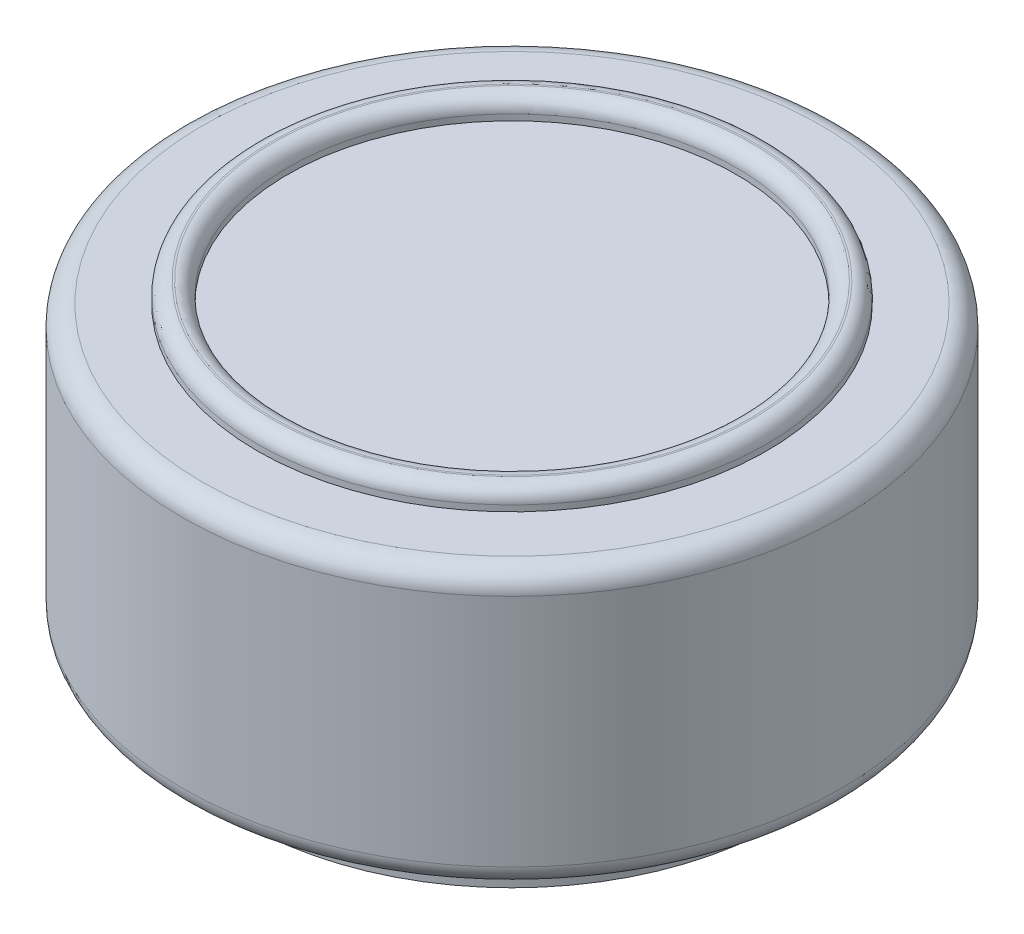
ISO-10303-21;
HEADER;
FILE_DESCRIPTION(('STEP AP214'),'2;1');
FILE_NAME('part.step','',(''),(''),'','','');
FILE_SCHEMA(('AUTOMOTIVE_DESIGN { 1 0 10303 214 1 1 1 1 }'));
ENDSEC;
DATA;
#1=APPLICATION_CONTEXT('core data for automotive mechanical design processes');
#2=APPLICATION_PROTOCOL_DEFINITION('international standard','automotive_design',2000,#1);
#3=PRODUCT_CONTEXT('',#1,'mechanical');
#4=PRODUCT('Part','Part','',(#3));
#5=PRODUCT_RELATED_PRODUCT_CATEGORY('part','',(#4));
#6=PRODUCT_DEFINITION_FORMATION('','',#4);
#7=PRODUCT_DEFINITION_CONTEXT('part definition',#1,'design');
#8=PRODUCT_DEFINITION('design','',#6,#7);
#9=PRODUCT_DEFINITION_SHAPE('','',#8);
#10=(LENGTH_UNIT() NAMED_UNIT(*) SI_UNIT(.MILLI.,.METRE.));
#11=(NAMED_UNIT(*) PLANE_ANGLE_UNIT() SI_UNIT($,.RADIAN.));
#12=(NAMED_UNIT(*) SI_UNIT($,.STERADIAN.) SOLID_ANGLE_UNIT());
#13=UNCERTAINTY_MEASURE_WITH_UNIT(LENGTH_MEASURE(1.E-05),#10,'distance_accuracy_value','');
#14=(GEOMETRIC_REPRESENTATION_CONTEXT(3) GLOBAL_UNCERTAINTY_ASSIGNED_CONTEXT((#13)) GLOBAL_UNIT_ASSIGNED_CONTEXT((#10,
#11,#12)) REPRESENTATION_CONTEXT('',''));
#15=CARTESIAN_POINT('',(0.,0.,0.));
#16=DIRECTION('',(0.,0.,1.));
#17=DIRECTION('',(1.,0.,0.));
#18=AXIS2_PLACEMENT_3D('',#15,#16,#17);
#19=CARTESIAN_POINT('',(0.,13.5,0.));
#20=DIRECTION('',(0.,-1.,0.));
#21=DIRECTION('',(0.,0.,-1.));
#22=AXIS2_PLACEMENT_3D('',#19,#20,#21);
#23=CYLINDRICAL_SURFACE('',#22,16.1655);
#24=CARTESIAN_POINT('',(0.,0.999999999999999,0.));
#25=DIRECTION('',(0.,1.,0.));
#26=DIRECTION('',(0.,0.,1.));
#27=AXIS2_PLACEMENT_3D('',#24,#25,#26);
#28=CIRCLE('',#27,16.1655);
#29=CARTESIAN_POINT('',(0.,0.999999999999999,16.1655));
#30=VERTEX_POINT('',#29);
#31=EDGE_CURVE('E63',#30,#30,#28,.T.);
#32=ORIENTED_EDGE('',*,*,#31,.T.);
#33=EDGE_LOOP('',(#32));
#34=FACE_BOUND('',#33,.T.);
#35=CARTESIAN_POINT('',(0.,12.5,0.));
#36=DIRECTION('',(0.,1.,0.));
#37=DIRECTION('',(0.,0.,1.));
#38=AXIS2_PLACEMENT_3D('',#35,#36,#37);
#39=CIRCLE('',#38,16.1655);
#40=CARTESIAN_POINT('',(0.,12.5,16.1655));
#41=VERTEX_POINT('',#40);
#42=EDGE_CURVE('E66',#41,#41,#39,.F.);
#43=ORIENTED_EDGE('',*,*,#42,.T.);
#44=EDGE_LOOP('',(#43));
#45=FACE_BOUND('',#44,.T.);
#46=ADVANCED_FACE('F31',(#34,#45),#23,.T.);
#47=CARTESIAN_POINT('',(0.,13.5,0.));
#48=DIRECTION('',(0.,1.,0.));
#49=DIRECTION('',(0.,0.,1.));
#50=AXIS2_PLACEMENT_3D('',#47,#48,#49);
#51=PLANE('',#50);
#52=CARTESIAN_POINT('',(0.,13.5,0.));
#53=DIRECTION('',(0.,1.,0.));
#54=DIRECTION('',(0.,0.,1.));
#55=AXIS2_PLACEMENT_3D('',#52,#53,#54);
#56=CIRCLE('',#55,12.5);
#57=CARTESIAN_POINT('',(0.,13.5,12.5));
#58=VERTEX_POINT('',#57);
#59=EDGE_CURVE('E69',#58,#58,#56,.T.);
#60=ORIENTED_EDGE('',*,*,#59,.F.);
#61=EDGE_LOOP('',(#60));
#62=FACE_BOUND('',#61,.T.);
#63=CARTESIAN_POINT('',(0.,13.5,0.));
#64=DIRECTION('',(0.,1.,0.));
#65=DIRECTION('',(0.,0.,1.));
#66=AXIS2_PLACEMENT_3D('',#63,#64,#65);
#67=CIRCLE('',#66,15.1655);
#68=CARTESIAN_POINT('',(0.,13.5,15.1655));
#69=VERTEX_POINT('',#68);
#70=EDGE_CURVE('E57',#69,#69,#67,.T.);
#71=ORIENTED_EDGE('',*,*,#70,.T.);
#72=EDGE_LOOP('',(#71));
#73=FACE_BOUND('',#72,.T.);
#74=ADVANCED_FACE('F90',(#62,#73),#51,.T.);
#75=CARTESIAN_POINT('',(0.,0.,0.));
#76=DIRECTION('',(0.,1.,0.));
#77=DIRECTION('',(0.,0.,1.));
#78=AXIS2_PLACEMENT_3D('',#75,#76,#77);
#79=PLANE('',#78);
#80=CARTESIAN_POINT('',(0.,0.,0.));
#81=DIRECTION('',(0.,1.,0.));
#82=DIRECTION('',(0.,0.,1.));
#83=AXIS2_PLACEMENT_3D('',#80,#81,#82);
#84=CIRCLE('',#83,13.1685147684479);
#85=CARTESIAN_POINT('',(0.,0.,13.1685147684479));
#86=VERTEX_POINT('',#85);
#87=EDGE_CURVE('E10',#86,#86,#84,.F.);
#88=ORIENTED_EDGE('',*,*,#87,.F.);
#89=EDGE_LOOP('',(#88));
#90=FACE_BOUND('',#89,.T.);
#91=CARTESIAN_POINT('',(0.,0.,0.));
#92=DIRECTION('',(0.,1.,0.));
#93=DIRECTION('',(0.,0.,1.));
#94=AXIS2_PLACEMENT_3D('',#91,#92,#93);
#95=CIRCLE('',#94,15.1655);
#96=CARTESIAN_POINT('',(0.,0.,15.1655));
#97=VERTEX_POINT('',#96);
#98=EDGE_CURVE('E60',#97,#97,#95,.F.);
#99=ORIENTED_EDGE('',*,*,#98,.T.);
#100=EDGE_LOOP('',(#99));
#101=FACE_BOUND('',#100,.T.);
#102=ADVANCED_FACE('F97',(#90,#101),#79,.F.);
#103=CARTESIAN_POINT('',(0.,0.999999999999999,0.));
#104=DIRECTION('',(0.,1.,0.));
#105=DIRECTION('',(0.,0.,1.));
#106=AXIS2_PLACEMENT_3D('',#103,#104,#105);
#107=TOROIDAL_SURFACE('',#106,15.1655,1.);
#108=ORIENTED_EDGE('',*,*,#98,.F.);
#109=EDGE_LOOP('',(#108));
#110=FACE_BOUND('',#109,.T.);
#111=ORIENTED_EDGE('',*,*,#31,.F.);
#112=EDGE_LOOP('',(#111));
#113=FACE_BOUND('',#112,.T.);
#114=ADVANCED_FACE('F104',(#110,#113),#107,.T.);
#115=CARTESIAN_POINT('',(0.,12.5,0.));
#116=DIRECTION('',(0.,1.,0.));
#117=DIRECTION('',(0.,0.,1.));
#118=AXIS2_PLACEMENT_3D('',#115,#116,#117);
#119=TOROIDAL_SURFACE('',#118,15.1655,1.);
#120=ORIENTED_EDGE('',*,*,#42,.F.);
#121=EDGE_LOOP('',(#120));
#122=FACE_BOUND('',#121,.T.);
#123=ORIENTED_EDGE('',*,*,#70,.F.);
#124=EDGE_LOOP('',(#123));
#125=FACE_BOUND('',#124,.T.);
#126=ADVANCED_FACE('F107',(#122,#125),#119,.T.);
#127=CARTESIAN_POINT('',(0.,14.5,0.));
#128=DIRECTION('',(0.,1.,0.));
#129=DIRECTION('',(0.,0.,1.));
#130=AXIS2_PLACEMENT_3D('',#127,#128,#129);
#131=PLANE('',#130);
#132=CARTESIAN_POINT('',(0.,14.5,0.));
#133=DIRECTION('',(0.,1.,0.));
#134=DIRECTION('',(0.,0.,1.));
#135=AXIS2_PLACEMENT_3D('',#132,#133,#134);
#136=CIRCLE('',#135,11.707);
#137=CARTESIAN_POINT('',(0.,14.5,11.707));
#138=VERTEX_POINT('',#137);
#139=EDGE_CURVE('E42',#138,#138,#136,.F.);
#140=ORIENTED_EDGE('',*,*,#139,.T.);
#141=EDGE_LOOP('',(#140));
#142=FACE_BOUND('',#141,.T.);
#143=CARTESIAN_POINT('',(0.,14.5,0.));
#144=DIRECTION('',(0.,1.,0.));
#145=DIRECTION('',(0.,0.,1.));
#146=AXIS2_PLACEMENT_3D('',#143,#144,#145);
#147=CIRCLE('',#146,11.793);
#148=CARTESIAN_POINT('',(0.,14.5,11.793));
#149=VERTEX_POINT('',#148);
#150=EDGE_CURVE('E46',#149,#149,#147,.T.);
#151=ORIENTED_EDGE('',*,*,#150,.T.);
#152=EDGE_LOOP('',(#151));
#153=FACE_BOUND('',#152,.T.);
#154=ADVANCED_FACE('F110',(#142,#153),#131,.T.);
#155=CARTESIAN_POINT('',(0.,14.5,0.));
#156=DIRECTION('',(0.,-1.,0.));
#157=DIRECTION('',(0.,0.,-1.));
#158=AXIS2_PLACEMENT_3D('',#155,#156,#157);
#159=CYLINDRICAL_SURFACE('',#158,12.5);
#160=CARTESIAN_POINT('',(0.,13.793,0.));
#161=DIRECTION('',(0.,1.,0.));
#162=DIRECTION('',(0.,0.,1.));
#163=AXIS2_PLACEMENT_3D('',#160,#161,#162);
#164=CIRCLE('',#163,12.5);
#165=CARTESIAN_POINT('',(0.,13.793,12.5));
#166=VERTEX_POINT('',#165);
#167=EDGE_CURVE('E38',#166,#166,#164,.F.);
#168=ORIENTED_EDGE('',*,*,#167,.T.);
#169=EDGE_LOOP('',(#168));
#170=FACE_BOUND('',#169,.T.);
#171=ORIENTED_EDGE('',*,*,#59,.T.);
#172=EDGE_LOOP('',(#171));
#173=FACE_BOUND('',#172,.T.);
#174=ADVANCED_FACE('F125',(#170,#173),#159,.T.);
#175=CARTESIAN_POINT('',(0.,14.5,0.));
#176=DIRECTION('',(0.,-1.,0.));
#177=DIRECTION('',(0.,0.,-1.));
#178=AXIS2_PLACEMENT_3D('',#175,#176,#177);
#179=CYLINDRICAL_SURFACE('',#178,11.);
#180=CARTESIAN_POINT('',(0.,13.793,0.));
#181=DIRECTION('',(0.,1.,0.));
#182=DIRECTION('',(0.,0.,1.));
#183=AXIS2_PLACEMENT_3D('',#180,#181,#182);
#184=CIRCLE('',#183,11.);
#185=CARTESIAN_POINT('',(0.,13.793,11.));
#186=VERTEX_POINT('',#185);
#187=EDGE_CURVE('E51',#186,#186,#184,.T.);
#188=ORIENTED_EDGE('',*,*,#187,.T.);
#189=EDGE_LOOP('',(#188));
#190=FACE_BOUND('',#189,.T.);
#191=CARTESIAN_POINT('',(0.,13.5,0.));
#192=DIRECTION('',(0.,1.,0.));
#193=DIRECTION('',(0.,0.,1.));
#194=AXIS2_PLACEMENT_3D('',#191,#192,#193);
#195=CIRCLE('',#194,11.);
#196=CARTESIAN_POINT('',(0.,13.5,11.));
#197=VERTEX_POINT('',#196);
#198=EDGE_CURVE('E54',#197,#197,#195,.F.);
#199=ORIENTED_EDGE('',*,*,#198,.T.);
#200=EDGE_LOOP('',(#199));
#201=FACE_BOUND('',#200,.T.);
#202=ADVANCED_FACE('F118',(#190,#201),#179,.F.);
#203=ORIENTED_EDGE('',*,*,#198,.F.);
#204=EDGE_LOOP('',(#203));
#205=FACE_BOUND('',#204,.T.);
#206=ADVANCED_FACE('F100',(#205),#51,.T.);
#207=CARTESIAN_POINT('',(0.,13.793,0.));
#208=DIRECTION('',(0.,1.,0.));
#209=DIRECTION('',(0.,0.,1.));
#210=AXIS2_PLACEMENT_3D('',#207,#208,#209);
#211=TOROIDAL_SURFACE('',#210,11.707,0.707);
#212=ORIENTED_EDGE('',*,*,#139,.F.);
#213=EDGE_LOOP('',(#212));
#214=FACE_BOUND('',#213,.T.);
#215=ORIENTED_EDGE('',*,*,#187,.F.);
#216=EDGE_LOOP('',(#215));
#217=FACE_BOUND('',#216,.T.);
#218=ADVANCED_FACE('F86',(#214,#217),#211,.T.);
#219=CARTESIAN_POINT('',(0.,13.793,0.));
#220=DIRECTION('',(0.,1.,0.));
#221=DIRECTION('',(0.,0.,1.));
#222=AXIS2_PLACEMENT_3D('',#219,#220,#221);
#223=TOROIDAL_SURFACE('',#222,11.793,0.707);
#224=ORIENTED_EDGE('',*,*,#167,.F.);
#225=EDGE_LOOP('',(#224));
#226=FACE_BOUND('',#225,.T.);
#227=ORIENTED_EDGE('',*,*,#150,.F.);
#228=EDGE_LOOP('',(#227));
#229=FACE_BOUND('',#228,.T.);
#230=ADVANCED_FACE('F33',(#226,#229),#223,.T.);
#231=CARTESIAN_POINT('',(0.,-2.,0.));
#232=DIRECTION('',(0.,1.,0.));
#233=DIRECTION('',(0.,0.,1.));
#234=AXIS2_PLACEMENT_3D('',#231,#232,#233);
#235=CYLINDRICAL_SURFACE('',#234,13.1685147684479);
#236=CARTESIAN_POINT('',(0.,-2.,0.));
#237=DIRECTION('',(0.,-1.,0.));
#238=DIRECTION('',(0.,0.,-1.));
#239=AXIS2_PLACEMENT_3D('',#236,#237,#238);
#240=CIRCLE('',#239,13.1685147684479);
#241=CARTESIAN_POINT('',(0.,-2.,-13.1685147684479));
#242=VERTEX_POINT('',#241);
#243=EDGE_CURVE('E72',#242,#242,#240,.T.);
#244=ORIENTED_EDGE('',*,*,#243,.F.);
#245=EDGE_LOOP('',(#244));
#246=FACE_BOUND('',#245,.T.);
#247=ORIENTED_EDGE('',*,*,#87,.T.);
#248=EDGE_LOOP('',(#247));
#249=FACE_BOUND('',#248,.T.);
#250=ADVANCED_FACE('F78',(#246,#249),#235,.T.);
#251=CARTESIAN_POINT('',(0.,-2.,0.));
#252=DIRECTION('',(0.,-1.,0.));
#253=DIRECTION('',(0.,0.,-1.));
#254=AXIS2_PLACEMENT_3D('',#251,#252,#253);
#255=PLANE('',#254);
#256=ORIENTED_EDGE('',*,*,#243,.T.);
#257=EDGE_LOOP('',(#256));
#258=FACE_BOUND('',#257,.T.);
#259=ADVANCED_FACE('F76',(#258),#255,.T.);
#260=CLOSED_SHELL('',(#46,#74,#102,#114,#126,#154,#174,#202,#206,#218,#230,#250,#259));
#261=MANIFOLD_SOLID_BREP('B2',#260);
#262=ADVANCED_BREP_SHAPE_REPRESENTATION('',(#18,#261),#14);
#263=SHAPE_DEFINITION_REPRESENTATION(#9,#262);
ENDSEC;
END-ISO-10303-21;
